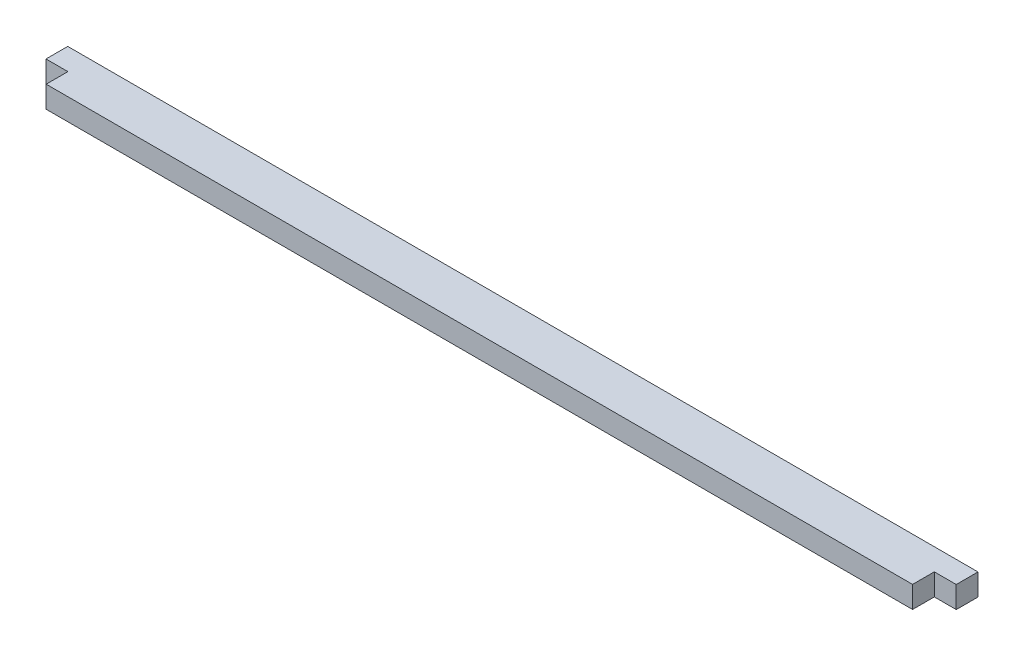
ISO-10303-21;
HEADER;
FILE_DESCRIPTION(('STEP AP214'),'2;1');
FILE_NAME('part.step','',(''),(''),'','','');
FILE_SCHEMA(('AUTOMOTIVE_DESIGN { 1 0 10303 214 1 1 1 1 }'));
ENDSEC;
DATA;
#1=APPLICATION_CONTEXT('core data for automotive mechanical design processes');
#2=APPLICATION_PROTOCOL_DEFINITION('international standard','automotive_design',2000,#1);
#3=PRODUCT_CONTEXT('',#1,'mechanical');
#4=PRODUCT('Part','Part','',(#3));
#5=PRODUCT_RELATED_PRODUCT_CATEGORY('part','',(#4));
#6=PRODUCT_DEFINITION_FORMATION('','',#4);
#7=PRODUCT_DEFINITION_CONTEXT('part definition',#1,'design');
#8=PRODUCT_DEFINITION('design','',#6,#7);
#9=PRODUCT_DEFINITION_SHAPE('','',#8);
#10=(LENGTH_UNIT() NAMED_UNIT(*) SI_UNIT(.MILLI.,.METRE.));
#11=(NAMED_UNIT(*) PLANE_ANGLE_UNIT() SI_UNIT($,.RADIAN.));
#12=(NAMED_UNIT(*) SI_UNIT($,.STERADIAN.) SOLID_ANGLE_UNIT());
#13=UNCERTAINTY_MEASURE_WITH_UNIT(LENGTH_MEASURE(1.E-05),#10,'distance_accuracy_value','');
#14=(GEOMETRIC_REPRESENTATION_CONTEXT(3) GLOBAL_UNCERTAINTY_ASSIGNED_CONTEXT((#13)) GLOBAL_UNIT_ASSIGNED_CONTEXT((#10,
#11,#12)) REPRESENTATION_CONTEXT('',''));
#15=CARTESIAN_POINT('',(0.,0.,0.));
#16=DIRECTION('',(0.,0.,1.));
#17=DIRECTION('',(1.,0.,0.));
#18=AXIS2_PLACEMENT_3D('',#15,#16,#17);
#19=CARTESIAN_POINT('',(132.8547,3.175,3.175));
#20=DIRECTION('',(-1.,0.,0.));
#21=DIRECTION('',(0.,0.,1.));
#22=AXIS2_PLACEMENT_3D('',#19,#20,#21);
#23=PLANE('',#22);
#24=DIRECTION('',(0.,0.,-1.));
#25=VECTOR('',#24,1.);
#26=CARTESIAN_POINT('',(132.8547,0.,3.175));
#27=LINE('',#26,#25);
#28=CARTESIAN_POINT('',(132.8547,0.,3.175));
#29=VERTEX_POINT('',#28);
#30=CARTESIAN_POINT('',(132.8547,0.,0.));
#31=VERTEX_POINT('',#30);
#32=EDGE_CURVE('E140',#29,#31,#27,.T.);
#33=ORIENTED_EDGE('',*,*,#32,.T.);
#34=DIRECTION('',(0.,-1.,0.));
#35=VECTOR('',#34,1.);
#36=CARTESIAN_POINT('',(132.8547,3.175,0.));
#37=LINE('',#36,#35);
#38=CARTESIAN_POINT('',(132.8547,3.175,0.));
#39=VERTEX_POINT('',#38);
#40=EDGE_CURVE('E11',#39,#31,#37,.T.);
#41=ORIENTED_EDGE('',*,*,#40,.F.);
#42=DIRECTION('',(0.,0.,-1.));
#43=VECTOR('',#42,1.);
#44=CARTESIAN_POINT('',(132.8547,3.175,3.175));
#45=LINE('',#44,#43);
#46=CARTESIAN_POINT('',(132.8547,3.175,3.175));
#47=VERTEX_POINT('',#46);
#48=EDGE_CURVE('E162',#47,#39,#45,.T.);
#49=ORIENTED_EDGE('',*,*,#48,.F.);
#50=DIRECTION('',(0.,-1.,0.));
#51=VECTOR('',#50,1.);
#52=CARTESIAN_POINT('',(132.8547,3.175,3.175));
#53=LINE('',#52,#51);
#54=EDGE_CURVE('E136',#47,#29,#53,.T.);
#55=ORIENTED_EDGE('',*,*,#54,.T.);
#56=EDGE_LOOP('',(#33,#41,#49,#55));
#57=FACE_BOUND('',#56,.T.);
#58=ADVANCED_FACE('F39',(#57),#23,.F.);
#59=CARTESIAN_POINT('',(0.,3.175,0.));
#60=DIRECTION('',(0.,0.,1.));
#61=DIRECTION('',(1.,0.,0.));
#62=AXIS2_PLACEMENT_3D('',#59,#60,#61);
#63=PLANE('',#62);
#64=DIRECTION('',(-1.,0.,0.));
#65=VECTOR('',#64,1.);
#66=CARTESIAN_POINT('',(0.,0.,0.));
#67=LINE('',#66,#65);
#68=CARTESIAN_POINT('',(0.,0.,0.));
#69=VERTEX_POINT('',#68);
#70=EDGE_CURVE('E144',#31,#69,#67,.T.);
#71=ORIENTED_EDGE('',*,*,#70,.T.);
#72=DIRECTION('',(0.,-1.,0.));
#73=VECTOR('',#72,1.);
#74=CARTESIAN_POINT('',(0.,3.175,0.));
#75=LINE('',#74,#73);
#76=CARTESIAN_POINT('',(0.,3.175,0.));
#77=VERTEX_POINT('',#76);
#78=EDGE_CURVE('E48',#77,#69,#75,.T.);
#79=ORIENTED_EDGE('',*,*,#78,.F.);
#80=DIRECTION('',(-1.,0.,0.));
#81=VECTOR('',#80,1.);
#82=CARTESIAN_POINT('',(0.,3.175,0.));
#83=LINE('',#82,#81);
#84=EDGE_CURVE('E99',#39,#77,#83,.T.);
#85=ORIENTED_EDGE('',*,*,#84,.F.);
#86=ORIENTED_EDGE('',*,*,#40,.T.);
#87=EDGE_LOOP('',(#71,#79,#85,#86));
#88=FACE_BOUND('',#87,.T.);
#89=ADVANCED_FACE('F208',(#88),#63,.F.);
#90=CARTESIAN_POINT('',(0.,3.175,3.17500000000001));
#91=DIRECTION('',(1.,0.,0.));
#92=DIRECTION('',(0.,0.,-1.));
#93=AXIS2_PLACEMENT_3D('',#90,#91,#92);
#94=PLANE('',#93);
#95=DIRECTION('',(0.,0.,1.));
#96=VECTOR('',#95,1.);
#97=CARTESIAN_POINT('',(0.,0.,3.17500000000001));
#98=LINE('',#97,#96);
#99=CARTESIAN_POINT('',(0.,0.,3.17500000000001));
#100=VERTEX_POINT('',#99);
#101=EDGE_CURVE('E147',#69,#100,#98,.T.);
#102=ORIENTED_EDGE('',*,*,#101,.T.);
#103=DIRECTION('',(0.,-1.,0.));
#104=VECTOR('',#103,1.);
#105=CARTESIAN_POINT('',(0.,3.175,3.17500000000001));
#106=LINE('',#105,#104);
#107=CARTESIAN_POINT('',(0.,3.175,3.17500000000001));
#108=VERTEX_POINT('',#107);
#109=EDGE_CURVE('E173',#108,#100,#106,.T.);
#110=ORIENTED_EDGE('',*,*,#109,.F.);
#111=DIRECTION('',(0.,0.,1.));
#112=VECTOR('',#111,1.);
#113=CARTESIAN_POINT('',(0.,3.175,3.17500000000001));
#114=LINE('',#113,#112);
#115=EDGE_CURVE('E183',#77,#108,#114,.T.);
#116=ORIENTED_EDGE('',*,*,#115,.F.);
#117=ORIENTED_EDGE('',*,*,#78,.T.);
#118=EDGE_LOOP('',(#102,#110,#116,#117));
#119=FACE_BOUND('',#118,.T.);
#120=ADVANCED_FACE('F181',(#119),#94,.F.);
#121=CARTESIAN_POINT('',(0.,3.175,3.17500000000001));
#122=DIRECTION('',(0.,0.,-1.));
#123=DIRECTION('',(-1.,0.,0.));
#124=AXIS2_PLACEMENT_3D('',#121,#122,#123);
#125=PLANE('',#124);
#126=DIRECTION('',(1.,0.,0.));
#127=VECTOR('',#126,1.);
#128=CARTESIAN_POINT('',(0.,0.,3.17500000000001));
#129=LINE('',#128,#127);
#130=CARTESIAN_POINT('',(3.20040000000001,0.,3.17500000000001));
#131=VERTEX_POINT('',#130);
#132=EDGE_CURVE('E150',#100,#131,#129,.T.);
#133=ORIENTED_EDGE('',*,*,#132,.T.);
#134=DIRECTION('',(0.,-1.,0.));
#135=VECTOR('',#134,1.);
#136=CARTESIAN_POINT('',(3.20040000000001,3.175,3.17500000000001));
#137=LINE('',#136,#135);
#138=CARTESIAN_POINT('',(3.20040000000001,3.175,3.17500000000001));
#139=VERTEX_POINT('',#138);
#140=EDGE_CURVE('E169',#139,#131,#137,.T.);
#141=ORIENTED_EDGE('',*,*,#140,.F.);
#142=DIRECTION('',(1.,0.,0.));
#143=VECTOR('',#142,1.);
#144=CARTESIAN_POINT('',(0.,3.175,3.17500000000001));
#145=LINE('',#144,#143);
#146=EDGE_CURVE('E196',#108,#139,#145,.T.);
#147=ORIENTED_EDGE('',*,*,#146,.F.);
#148=ORIENTED_EDGE('',*,*,#109,.T.);
#149=EDGE_LOOP('',(#133,#141,#147,#148));
#150=FACE_BOUND('',#149,.T.);
#151=ADVANCED_FACE('F191',(#150),#125,.F.);
#152=CARTESIAN_POINT('',(3.20040000000001,3.175,6.35));
#153=DIRECTION('',(1.,0.,0.));
#154=DIRECTION('',(0.,0.,-1.));
#155=AXIS2_PLACEMENT_3D('',#152,#153,#154);
#156=PLANE('',#155);
#157=DIRECTION('',(0.,0.,1.));
#158=VECTOR('',#157,1.);
#159=CARTESIAN_POINT('',(3.20040000000001,0.,6.35));
#160=LINE('',#159,#158);
#161=CARTESIAN_POINT('',(3.20040000000001,0.,6.35));
#162=VERTEX_POINT('',#161);
#163=EDGE_CURVE('E153',#131,#162,#160,.T.);
#164=ORIENTED_EDGE('',*,*,#163,.T.);
#165=DIRECTION('',(0.,-1.,0.));
#166=VECTOR('',#165,1.);
#167=CARTESIAN_POINT('',(3.20040000000001,3.175,6.35));
#168=LINE('',#167,#166);
#169=CARTESIAN_POINT('',(3.20040000000001,3.175,6.35));
#170=VERTEX_POINT('',#169);
#171=EDGE_CURVE('E129',#170,#162,#168,.T.);
#172=ORIENTED_EDGE('',*,*,#171,.F.);
#173=DIRECTION('',(0.,0.,1.));
#174=VECTOR('',#173,1.);
#175=CARTESIAN_POINT('',(3.20040000000001,3.175,6.35));
#176=LINE('',#175,#174);
#177=EDGE_CURVE('E118',#139,#170,#176,.T.);
#178=ORIENTED_EDGE('',*,*,#177,.F.);
#179=ORIENTED_EDGE('',*,*,#140,.T.);
#180=EDGE_LOOP('',(#164,#172,#178,#179));
#181=FACE_BOUND('',#180,.T.);
#182=ADVANCED_FACE('F194',(#181),#156,.F.);
#183=CARTESIAN_POINT('',(3.20040000000001,3.175,6.35));
#184=DIRECTION('',(0.,0.,-1.));
#185=DIRECTION('',(-1.,0.,0.));
#186=AXIS2_PLACEMENT_3D('',#183,#184,#185);
#187=PLANE('',#186);
#188=DIRECTION('',(1.,0.,0.));
#189=VECTOR('',#188,1.);
#190=CARTESIAN_POINT('',(3.20040000000001,0.,6.35));
#191=LINE('',#190,#189);
#192=CARTESIAN_POINT('',(129.6543,0.,6.35));
#193=VERTEX_POINT('',#192);
#194=EDGE_CURVE('E127',#162,#193,#191,.T.);
#195=ORIENTED_EDGE('',*,*,#194,.T.);
#196=DIRECTION('',(0.,-1.,0.));
#197=VECTOR('',#196,1.);
#198=CARTESIAN_POINT('',(129.6543,3.175,6.35));
#199=LINE('',#198,#197);
#200=CARTESIAN_POINT('',(129.6543,3.175,6.35));
#201=VERTEX_POINT('',#200);
#202=EDGE_CURVE('E124',#201,#193,#199,.T.);
#203=ORIENTED_EDGE('',*,*,#202,.F.);
#204=DIRECTION('',(1.,0.,0.));
#205=VECTOR('',#204,1.);
#206=CARTESIAN_POINT('',(3.20040000000001,3.175,6.35));
#207=LINE('',#206,#205);
#208=EDGE_CURVE('E112',#170,#201,#207,.T.);
#209=ORIENTED_EDGE('',*,*,#208,.F.);
#210=ORIENTED_EDGE('',*,*,#171,.T.);
#211=EDGE_LOOP('',(#195,#203,#209,#210));
#212=FACE_BOUND('',#211,.T.);
#213=ADVANCED_FACE('F125',(#212),#187,.F.);
#214=CARTESIAN_POINT('',(129.6543,3.175,6.35));
#215=DIRECTION('',(-1.,0.,0.));
#216=DIRECTION('',(0.,0.,1.));
#217=AXIS2_PLACEMENT_3D('',#214,#215,#216);
#218=PLANE('',#217);
#219=DIRECTION('',(0.,0.,-1.));
#220=VECTOR('',#219,1.);
#221=CARTESIAN_POINT('',(129.6543,0.,6.35));
#222=LINE('',#221,#220);
#223=CARTESIAN_POINT('',(129.6543,0.,3.175));
#224=VERTEX_POINT('',#223);
#225=EDGE_CURVE('E85',#193,#224,#222,.T.);
#226=ORIENTED_EDGE('',*,*,#225,.T.);
#227=DIRECTION('',(0.,-1.,0.));
#228=VECTOR('',#227,1.);
#229=CARTESIAN_POINT('',(129.6543,3.175,3.175));
#230=LINE('',#229,#228);
#231=CARTESIAN_POINT('',(129.6543,3.175,3.175));
#232=VERTEX_POINT('',#231);
#233=EDGE_CURVE('E130',#232,#224,#230,.T.);
#234=ORIENTED_EDGE('',*,*,#233,.F.);
#235=DIRECTION('',(0.,0.,-1.));
#236=VECTOR('',#235,1.);
#237=CARTESIAN_POINT('',(129.6543,3.175,6.35));
#238=LINE('',#237,#236);
#239=EDGE_CURVE('E116',#201,#232,#238,.T.);
#240=ORIENTED_EDGE('',*,*,#239,.F.);
#241=ORIENTED_EDGE('',*,*,#202,.T.);
#242=EDGE_LOOP('',(#226,#234,#240,#241));
#243=FACE_BOUND('',#242,.T.);
#244=ADVANCED_FACE('F132',(#243),#218,.F.);
#245=CARTESIAN_POINT('',(132.8547,3.175,3.175));
#246=DIRECTION('',(0.,0.,-1.));
#247=DIRECTION('',(-1.,0.,0.));
#248=AXIS2_PLACEMENT_3D('',#245,#246,#247);
#249=PLANE('',#248);
#250=DIRECTION('',(1.,0.,0.));
#251=VECTOR('',#250,1.);
#252=CARTESIAN_POINT('',(132.8547,0.,3.175));
#253=LINE('',#252,#251);
#254=EDGE_CURVE('E91',#224,#29,#253,.T.);
#255=ORIENTED_EDGE('',*,*,#254,.T.);
#256=ORIENTED_EDGE('',*,*,#54,.F.);
#257=DIRECTION('',(1.,0.,0.));
#258=VECTOR('',#257,1.);
#259=CARTESIAN_POINT('',(132.8547,3.175,3.175));
#260=LINE('',#259,#258);
#261=EDGE_CURVE('E56',#232,#47,#260,.T.);
#262=ORIENTED_EDGE('',*,*,#261,.F.);
#263=ORIENTED_EDGE('',*,*,#233,.T.);
#264=EDGE_LOOP('',(#255,#256,#262,#263));
#265=FACE_BOUND('',#264,.T.);
#266=ADVANCED_FACE('F224',(#265),#249,.F.);
#267=CARTESIAN_POINT('',(0.,3.175,0.));
#268=DIRECTION('',(0.,-1.,0.));
#269=DIRECTION('',(0.,0.,-1.));
#270=AXIS2_PLACEMENT_3D('',#267,#268,#269);
#271=PLANE('',#270);
#272=ORIENTED_EDGE('',*,*,#48,.T.);
#273=ORIENTED_EDGE('',*,*,#84,.T.);
#274=ORIENTED_EDGE('',*,*,#115,.T.);
#275=ORIENTED_EDGE('',*,*,#146,.T.);
#276=ORIENTED_EDGE('',*,*,#177,.T.);
#277=ORIENTED_EDGE('',*,*,#208,.T.);
#278=ORIENTED_EDGE('',*,*,#239,.T.);
#279=ORIENTED_EDGE('',*,*,#261,.T.);
#280=EDGE_LOOP('',(#272,#273,#274,#275,#276,#277,#278,#279));
#281=FACE_BOUND('',#280,.T.);
#282=ADVANCED_FACE('F114',(#281),#271,.F.);
#283=CARTESIAN_POINT('',(0.,0.,0.));
#284=DIRECTION('',(0.,-1.,0.));
#285=DIRECTION('',(0.,0.,-1.));
#286=AXIS2_PLACEMENT_3D('',#283,#284,#285);
#287=PLANE('',#286);
#288=ORIENTED_EDGE('',*,*,#32,.F.);
#289=ORIENTED_EDGE('',*,*,#254,.F.);
#290=ORIENTED_EDGE('',*,*,#225,.F.);
#291=ORIENTED_EDGE('',*,*,#194,.F.);
#292=ORIENTED_EDGE('',*,*,#163,.F.);
#293=ORIENTED_EDGE('',*,*,#132,.F.);
#294=ORIENTED_EDGE('',*,*,#101,.F.);
#295=ORIENTED_EDGE('',*,*,#70,.F.);
#296=EDGE_LOOP('',(#288,#289,#290,#291,#292,#293,#294,#295));
#297=FACE_BOUND('',#296,.T.);
#298=ADVANCED_FACE('F187',(#297),#287,.T.);
#299=CLOSED_SHELL('',(#58,#89,#120,#151,#182,#213,#244,#266,#282,#298));
#300=MANIFOLD_SOLID_BREP('B2',#299);
#301=ADVANCED_BREP_SHAPE_REPRESENTATION('',(#18,#300),#14);
#302=SHAPE_DEFINITION_REPRESENTATION(#9,#301);
ENDSEC;
END-ISO-10303-21;
